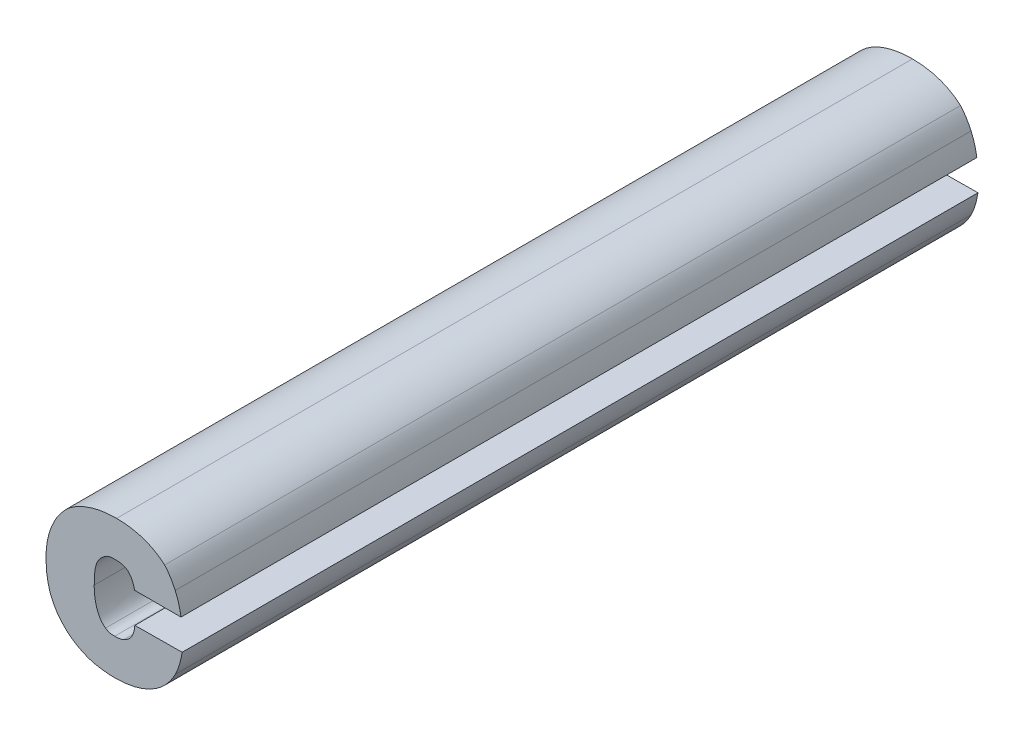
ISO-10303-21;
HEADER;
FILE_DESCRIPTION(('STEP AP214'),'2;1');
FILE_NAME('part.step','',(''),(''),'','','');
FILE_SCHEMA(('AUTOMOTIVE_DESIGN { 1 0 10303 214 1 1 1 1 }'));
ENDSEC;
DATA;
#1=APPLICATION_CONTEXT('core data for automotive mechanical design processes');
#2=APPLICATION_PROTOCOL_DEFINITION('international standard','automotive_design',2000,#1);
#3=PRODUCT_CONTEXT('',#1,'mechanical');
#4=PRODUCT('Part','Part','',(#3));
#5=PRODUCT_RELATED_PRODUCT_CATEGORY('part','',(#4));
#6=PRODUCT_DEFINITION_FORMATION('','',#4);
#7=PRODUCT_DEFINITION_CONTEXT('part definition',#1,'design');
#8=PRODUCT_DEFINITION('design','',#6,#7);
#9=PRODUCT_DEFINITION_SHAPE('','',#8);
#10=(LENGTH_UNIT() NAMED_UNIT(*) SI_UNIT(.MILLI.,.METRE.));
#11=(NAMED_UNIT(*) PLANE_ANGLE_UNIT() SI_UNIT($,.RADIAN.));
#12=(NAMED_UNIT(*) SI_UNIT($,.STERADIAN.) SOLID_ANGLE_UNIT());
#13=UNCERTAINTY_MEASURE_WITH_UNIT(LENGTH_MEASURE(1.E-05),#10,'distance_accuracy_value','');
#14=(GEOMETRIC_REPRESENTATION_CONTEXT(3) GLOBAL_UNCERTAINTY_ASSIGNED_CONTEXT((#13)) GLOBAL_UNIT_ASSIGNED_CONTEXT((#10,
#11,#12)) REPRESENTATION_CONTEXT('',''));
#15=CARTESIAN_POINT('',(0.,0.,0.));
#16=DIRECTION('',(0.,0.,1.));
#17=DIRECTION('',(1.,0.,0.));
#18=AXIS2_PLACEMENT_3D('',#15,#16,#17);
#19=CARTESIAN_POINT('',(1.4394014958136,0.0293407791099617,0.));
#20=CARTESIAN_POINT('',(1.4394014958136,0.0293407791099617,0.1));
#21=CARTESIAN_POINT('',(1.4396914459576,0.0295930409879627,0.));
#22=CARTESIAN_POINT('',(1.4396914459576,0.0295930409879627,0.1));
#23=CARTESIAN_POINT('',(1.4399814040603,0.0298974898329773,0.));
#24=CARTESIAN_POINT('',(1.4399814040603,0.0298974898329773,0.1));
#25=CARTESIAN_POINT('',(1.4408802638323,0.0298974898329742,0.));
#26=CARTESIAN_POINT('',(1.4408802638323,0.0298974898329742,0.1));
#27=B_SPLINE_SURFACE_WITH_KNOTS('',3,1,((#19,#20),(#21,#22),(#23,#24),(#25,#26)),.UNSPECIFIED.,
.F.,.F.,.F.,(4,4),(2,2),(-1.,0.),(0.,0.01),.UNSPECIFIED.);
#28=CARTESIAN_POINT('',(1.4408802638323,0.0298974898329742,0.));
#29=CARTESIAN_POINT('',(1.4399814040603,0.0298974898329773,0.));
#30=CARTESIAN_POINT('',(1.4396914459576,0.0295930409879627,0.));
#31=CARTESIAN_POINT('',(1.4394014958136,0.0293407791099617,0.));
#32=B_SPLINE_CURVE_WITH_KNOTS('',3,(#28,#29,#30,#31),.UNSPECIFIED.,.F.,.F.,(4,4),(0.,1.),.UNSPECIFIED.);
#33=CARTESIAN_POINT('',(1.4408802638323,0.0298974898329742,0.));
#34=VERTEX_POINT('',#33);
#35=CARTESIAN_POINT('',(1.4394014958136,0.0293407791099617,0.));
#36=VERTEX_POINT('',#35);
#37=EDGE_CURVE('E11',#34,#36,#32,.T.);
#38=DIRECTION('',(0.,0.,1.));
#39=VECTOR('',#38,1.);
#40=CARTESIAN_POINT('',(1.4408802638323,0.0298974898329742,0.));
#41=LINE('',#40,#39);
#42=CARTESIAN_POINT('',(1.4408802638323,0.0298974898329742,0.1));
#43=VERTEX_POINT('',#42);
#44=EDGE_CURVE('E28',#34,#43,#41,.T.);
#45=CARTESIAN_POINT('',(1.4394014958136,0.0293407791099617,0.1));
#46=CARTESIAN_POINT('',(1.4396914459576,0.0295930409879627,0.1));
#47=CARTESIAN_POINT('',(1.4399814040603,0.0298974898329773,0.1));
#48=CARTESIAN_POINT('',(1.4408802638323,0.0298974898329742,0.1));
#49=B_SPLINE_CURVE_WITH_KNOTS('',3,(#45,#46,#47,#48),.UNSPECIFIED.,.F.,.F.,(4,4),(-1.,0.),.UNSPECIFIED.);
#50=CARTESIAN_POINT('',(1.4394014958136,0.0293407791099617,0.1));
#51=VERTEX_POINT('',#50);
#52=EDGE_CURVE('E176',#51,#43,#49,.T.);
#53=DIRECTION('',(0.,0.,1.));
#54=VECTOR('',#53,1.);
#55=CARTESIAN_POINT('',(1.4394014958136,0.0293407791099617,0.));
#56=LINE('',#55,#54);
#57=EDGE_CURVE('E480',#36,#51,#56,.T.);
#58=ORIENTED_EDGE('',*,*,#37,.F.);
#59=ORIENTED_EDGE('',*,*,#44,.T.);
#60=ORIENTED_EDGE('',*,*,#52,.F.);
#61=ORIENTED_EDGE('',*,*,#57,.F.);
#62=EDGE_LOOP('',(#58,#59,#60,#61));
#63=FACE_BOUND('',#62,.T.);
#64=ADVANCED_FACE('F17',(#63),#27,.T.);
#65=CARTESIAN_POINT('',(1.4383576530109,0.0257859292219617,0.));
#66=CARTESIAN_POINT('',(1.4383576530109,0.0257859292219617,0.1));
#67=CARTESIAN_POINT('',(1.4383576530332,0.0278475083954069,0.));
#68=CARTESIAN_POINT('',(1.4383576530332,0.0278475083954069,0.1));
#69=CARTESIAN_POINT('',(1.4386186117318,0.0286738806352979,0.));
#70=CARTESIAN_POINT('',(1.4386186117318,0.0286738806352979,0.1));
#71=CARTESIAN_POINT('',(1.4394014958136,0.0293407791099617,0.));
#72=CARTESIAN_POINT('',(1.4394014958136,0.0293407791099617,0.1));
#73=B_SPLINE_SURFACE_WITH_KNOTS('',3,1,((#65,#66),(#67,#68),(#69,#70),(#71,#72)),.UNSPECIFIED.,
.F.,.F.,.F.,(4,4),(2,2),(-1.,0.),(0.,0.01),.UNSPECIFIED.);
#74=CARTESIAN_POINT('',(1.4394014958136,0.0293407791099617,0.));
#75=CARTESIAN_POINT('',(1.4386186117318,0.0286738806352979,0.));
#76=CARTESIAN_POINT('',(1.4383576530332,0.0278475083954069,0.));
#77=CARTESIAN_POINT('',(1.4383576530109,0.0257859292219617,0.));
#78=B_SPLINE_CURVE_WITH_KNOTS('',3,(#74,#75,#76,#77),.UNSPECIFIED.,.F.,.F.,(4,4),(0.,1.),.UNSPECIFIED.);
#79=CARTESIAN_POINT('',(1.4383576530109,0.0257859292219617,0.));
#80=VERTEX_POINT('',#79);
#81=EDGE_CURVE('E473',#36,#80,#78,.T.);
#82=CARTESIAN_POINT('',(1.4383576530109,0.0257859292219617,0.1));
#83=CARTESIAN_POINT('',(1.4383576530332,0.0278475083954069,0.1));
#84=CARTESIAN_POINT('',(1.4386186117318,0.0286738806352979,0.1));
#85=CARTESIAN_POINT('',(1.4394014958136,0.0293407791099617,0.1));
#86=B_SPLINE_CURVE_WITH_KNOTS('',3,(#82,#83,#84,#85),.UNSPECIFIED.,.F.,.F.,(4,4),(-1.,0.),.UNSPECIFIED.);
#87=CARTESIAN_POINT('',(1.4383576530109,0.0257859292219617,0.1));
#88=VERTEX_POINT('',#87);
#89=EDGE_CURVE('E469',#88,#51,#86,.T.);
#90=DIRECTION('',(0.,0.,1.));
#91=VECTOR('',#90,1.);
#92=CARTESIAN_POINT('',(1.4383576530109,0.0257859292219617,0.));
#93=LINE('',#92,#91);
#94=EDGE_CURVE('E463',#80,#88,#93,.T.);
#95=ORIENTED_EDGE('',*,*,#81,.F.);
#96=ORIENTED_EDGE('',*,*,#57,.T.);
#97=ORIENTED_EDGE('',*,*,#89,.F.);
#98=ORIENTED_EDGE('',*,*,#94,.F.);
#99=EDGE_LOOP('',(#95,#96,#97,#98));
#100=FACE_BOUND('',#99,.T.);
#101=ADVANCED_FACE('F558',(#100),#73,.T.);
#102=CARTESIAN_POINT('',(1.4397784341843,0.0218280444952952,0.));
#103=CARTESIAN_POINT('',(1.4397784341843,0.0218280444952952,0.1));
#104=CARTESIAN_POINT('',(1.4382706667306,0.0228747782849252,0.));
#105=CARTESIAN_POINT('',(1.4382706667306,0.0228747782849252,0.1));
#106=CARTESIAN_POINT('',(1.4383576530086,0.0256293484242973,0.));
#107=CARTESIAN_POINT('',(1.4383576530086,0.0256293484242973,0.1));
#108=CARTESIAN_POINT('',(1.4383576530109,0.0257859292219617,0.));
#109=CARTESIAN_POINT('',(1.4383576530109,0.0257859292219617,0.1));
#110=B_SPLINE_SURFACE_WITH_KNOTS('',3,1,((#102,#103),(#104,#105),(#106,#107),(#108,#109)),
.UNSPECIFIED.,.F.,.F.,.F.,(4,4),(2,2),(-1.,0.),(0.,0.01),.UNSPECIFIED.);
#111=CARTESIAN_POINT('',(1.4383576530109,0.0257859292219617,0.));
#112=CARTESIAN_POINT('',(1.4383576530086,0.0256293484242973,0.));
#113=CARTESIAN_POINT('',(1.4382706667306,0.0228747782849252,0.));
#114=CARTESIAN_POINT('',(1.4397784341843,0.0218280444952952,0.));
#115=B_SPLINE_CURVE_WITH_KNOTS('',3,(#111,#112,#113,#114),.UNSPECIFIED.,.F.,.F.,(4,4),(0.,1.),.UNSPECIFIED.);
#116=CARTESIAN_POINT('',(1.4397784341843,0.0218280444952952,0.));
#117=VERTEX_POINT('',#116);
#118=EDGE_CURVE('E456',#80,#117,#115,.T.);
#119=CARTESIAN_POINT('',(1.4397784341843,0.0218280444952952,0.1));
#120=CARTESIAN_POINT('',(1.4382706667306,0.0228747782849252,0.1));
#121=CARTESIAN_POINT('',(1.4383576530086,0.0256293484242973,0.1));
#122=CARTESIAN_POINT('',(1.4383576530109,0.0257859292219617,0.1));
#123=B_SPLINE_CURVE_WITH_KNOTS('',3,(#119,#120,#121,#122),.UNSPECIFIED.,.F.,.F.,(4,4),(-1.,0.),.UNSPECIFIED.);
#124=CARTESIAN_POINT('',(1.4397784341843,0.0218280444952952,0.1));
#125=VERTEX_POINT('',#124);
#126=EDGE_CURVE('E451',#125,#88,#123,.T.);
#127=DIRECTION('',(0.,0.,1.));
#128=VECTOR('',#127,1.);
#129=CARTESIAN_POINT('',(1.4397784341843,0.0218280444952952,0.));
#130=LINE('',#129,#128);
#131=EDGE_CURVE('E445',#117,#125,#130,.T.);
#132=ORIENTED_EDGE('',*,*,#118,.F.);
#133=ORIENTED_EDGE('',*,*,#94,.T.);
#134=ORIENTED_EDGE('',*,*,#126,.F.);
#135=ORIENTED_EDGE('',*,*,#131,.F.);
#136=EDGE_LOOP('',(#132,#133,#134,#135));
#137=FACE_BOUND('',#136,.T.);
#138=ADVANCED_FACE('F554',(#137),#110,.T.);
#139=CARTESIAN_POINT('',(1.4409382546569,0.0215235896812952,0.));
#140=CARTESIAN_POINT('',(1.4409382546569,0.0215235896812952,0.1));
#141=CARTESIAN_POINT('',(1.4404163352498,0.0215235896908047,0.));
#142=CARTESIAN_POINT('',(1.4404163352498,0.0215235896908047,0.1));
#143=CARTESIAN_POINT('',(1.4402133653736,0.0215409833537755,0.));
#144=CARTESIAN_POINT('',(1.4402133653736,0.0215409833537755,0.1));
#145=CARTESIAN_POINT('',(1.4397784341843,0.0218280444952952,0.));
#146=CARTESIAN_POINT('',(1.4397784341843,0.0218280444952952,0.1));
#147=B_SPLINE_SURFACE_WITH_KNOTS('',3,1,((#139,#140),(#141,#142),(#143,#144),(#145,#146)),
.UNSPECIFIED.,.F.,.F.,.F.,(4,4),(2,2),(-1.,0.),(0.,0.01),.UNSPECIFIED.);
#148=CARTESIAN_POINT('',(1.4397784341843,0.0218280444952952,0.));
#149=CARTESIAN_POINT('',(1.4402133653736,0.0215409833537755,0.));
#150=CARTESIAN_POINT('',(1.4404163352498,0.0215235896908047,0.));
#151=CARTESIAN_POINT('',(1.4409382546569,0.0215235896812952,0.));
#152=B_SPLINE_CURVE_WITH_KNOTS('',3,(#148,#149,#150,#151),.UNSPECIFIED.,.F.,.F.,(4,4),(0.,1.),.UNSPECIFIED.);
#153=CARTESIAN_POINT('',(1.4409382546569,0.0215235896812952,0.));
#154=VERTEX_POINT('',#153);
#155=EDGE_CURVE('E438',#117,#154,#152,.T.);
#156=CARTESIAN_POINT('',(1.4409382546569,0.0215235896812952,0.1));
#157=CARTESIAN_POINT('',(1.4404163352498,0.0215235896908047,0.1));
#158=CARTESIAN_POINT('',(1.4402133653736,0.0215409833537755,0.1));
#159=CARTESIAN_POINT('',(1.4397784341843,0.0218280444952952,0.1));
#160=B_SPLINE_CURVE_WITH_KNOTS('',3,(#156,#157,#158,#159),.UNSPECIFIED.,.F.,.F.,(4,4),(-1.,0.),.UNSPECIFIED.);
#161=CARTESIAN_POINT('',(1.4409382546569,0.0215235896812952,0.1));
#162=VERTEX_POINT('',#161);
#163=EDGE_CURVE('E433',#162,#125,#160,.T.);
#164=DIRECTION('',(0.,0.,1.));
#165=VECTOR('',#164,1.);
#166=CARTESIAN_POINT('',(1.4409382546569,0.0215235896812952,0.));
#167=LINE('',#166,#165);
#168=EDGE_CURVE('E427',#154,#162,#167,.T.);
#169=ORIENTED_EDGE('',*,*,#155,.F.);
#170=ORIENTED_EDGE('',*,*,#131,.T.);
#171=ORIENTED_EDGE('',*,*,#163,.F.);
#172=ORIENTED_EDGE('',*,*,#168,.F.);
#173=EDGE_LOOP('',(#169,#170,#171,#172));
#174=FACE_BOUND('',#173,.T.);
#175=ADVANCED_FACE('F550',(#174),#147,.T.);
#176=CARTESIAN_POINT('',(1.4420980751296,0.0217265615469617,0.));
#177=CARTESIAN_POINT('',(1.4420980751296,0.0217265615469617,0.1));
#178=CARTESIAN_POINT('',(1.4416341445529,0.0215061900462939,0.));
#179=CARTESIAN_POINT('',(1.4416341445529,0.0215061900462939,0.1));
#180=CARTESIAN_POINT('',(1.4411122271309,0.0215235896812992,0.));
#181=CARTESIAN_POINT('',(1.4411122271309,0.0215235896812992,0.1));
#182=CARTESIAN_POINT('',(1.4409382546569,0.0215235896812952,0.));
#183=CARTESIAN_POINT('',(1.4409382546569,0.0215235896812952,0.1));
#184=B_SPLINE_SURFACE_WITH_KNOTS('',3,1,((#176,#177),(#178,#179),(#180,#181),(#182,#183)),
.UNSPECIFIED.,.F.,.F.,.F.,(4,4),(2,2),(-1.,0.),(0.,0.01),.UNSPECIFIED.);
#185=CARTESIAN_POINT('',(1.4409382546569,0.0215235896812952,0.));
#186=CARTESIAN_POINT('',(1.4411122271309,0.0215235896812992,0.));
#187=CARTESIAN_POINT('',(1.4416341445529,0.0215061900462939,0.));
#188=CARTESIAN_POINT('',(1.4420980751296,0.0217265615469617,0.));
#189=B_SPLINE_CURVE_WITH_KNOTS('',3,(#185,#186,#187,#188),.UNSPECIFIED.,.F.,.F.,(4,4),(0.,1.),.UNSPECIFIED.);
#190=CARTESIAN_POINT('',(1.4420980751296,0.0217265615469617,0.));
#191=VERTEX_POINT('',#190);
#192=EDGE_CURVE('E420',#154,#191,#189,.T.);
#193=CARTESIAN_POINT('',(1.4420980751296,0.0217265615469617,0.1));
#194=CARTESIAN_POINT('',(1.4416341445529,0.0215061900462939,0.1));
#195=CARTESIAN_POINT('',(1.4411122271309,0.0215235896812992,0.1));
#196=CARTESIAN_POINT('',(1.4409382546569,0.0215235896812952,0.1));
#197=B_SPLINE_CURVE_WITH_KNOTS('',3,(#193,#194,#195,#196),.UNSPECIFIED.,.F.,.F.,(4,4),(-1.,0.),.UNSPECIFIED.);
#198=CARTESIAN_POINT('',(1.4420980751296,0.0217265615469617,0.1));
#199=VERTEX_POINT('',#198);
#200=EDGE_CURVE('E415',#199,#162,#197,.T.);
#201=DIRECTION('',(0.,0.,1.));
#202=VECTOR('',#201,1.);
#203=CARTESIAN_POINT('',(1.4420980751296,0.0217265615469617,0.));
#204=LINE('',#203,#202);
#205=EDGE_CURVE('E409',#191,#199,#204,.T.);
#206=ORIENTED_EDGE('',*,*,#192,.F.);
#207=ORIENTED_EDGE('',*,*,#168,.T.);
#208=ORIENTED_EDGE('',*,*,#200,.F.);
#209=ORIENTED_EDGE('',*,*,#205,.F.);
#210=EDGE_LOOP('',(#206,#207,#208,#209));
#211=FACE_BOUND('',#210,.T.);
#212=ADVANCED_FACE('F546',(#211),#184,.T.);
#213=CARTESIAN_POINT('',(1.4434608654783,0.0239621112202952,0.));
#214=CARTESIAN_POINT('',(1.4434608654783,0.0239621112202952,0.1));
#215=CARTESIAN_POINT('',(1.4433448818562,0.0225326331876867,0.));
#216=CARTESIAN_POINT('',(1.4433448818562,0.0225326331876867,0.1));
#217=CARTESIAN_POINT('',(1.4427069787945,0.0220107157791317,0.));
#218=CARTESIAN_POINT('',(1.4427069787945,0.0220107157791317,0.1));
#219=CARTESIAN_POINT('',(1.4420980751296,0.0217265615469617,0.));
#220=CARTESIAN_POINT('',(1.4420980751296,0.0217265615469617,0.1));
#221=B_SPLINE_SURFACE_WITH_KNOTS('',3,1,((#213,#214),(#215,#216),(#217,#218),(#219,#220)),
.UNSPECIFIED.,.F.,.F.,.F.,(4,4),(2,2),(-1.,0.),(0.,0.01),.UNSPECIFIED.);
#222=CARTESIAN_POINT('',(1.4420980751296,0.0217265615469617,0.));
#223=CARTESIAN_POINT('',(1.4427069787945,0.0220107157791317,0.));
#224=CARTESIAN_POINT('',(1.4433448818562,0.0225326331876867,0.));
#225=CARTESIAN_POINT('',(1.4434608654783,0.0239621112202952,0.));
#226=B_SPLINE_CURVE_WITH_KNOTS('',3,(#222,#223,#224,#225),.UNSPECIFIED.,.F.,.F.,(4,4),(0.,1.),.UNSPECIFIED.);
#227=CARTESIAN_POINT('',(1.4434608654783,0.0239621112202952,0.));
#228=VERTEX_POINT('',#227);
#229=EDGE_CURVE('E402',#191,#228,#226,.T.);
#230=CARTESIAN_POINT('',(1.4434608654783,0.0239621112202952,0.1));
#231=CARTESIAN_POINT('',(1.4433448818562,0.0225326331876867,0.1));
#232=CARTESIAN_POINT('',(1.4427069787945,0.0220107157791317,0.1));
#233=CARTESIAN_POINT('',(1.4420980751296,0.0217265615469617,0.1));
#234=B_SPLINE_CURVE_WITH_KNOTS('',3,(#230,#231,#232,#233),.UNSPECIFIED.,.F.,.F.,(4,4),(-1.,0.),.UNSPECIFIED.);
#235=CARTESIAN_POINT('',(1.4434608654783,0.0239621112202952,0.1));
#236=VERTEX_POINT('',#235);
#237=EDGE_CURVE('E397',#236,#199,#234,.T.);
#238=DIRECTION('',(0.,0.,1.));
#239=VECTOR('',#238,1.);
#240=CARTESIAN_POINT('',(1.4434608654783,0.0239621112202952,0.));
#241=LINE('',#240,#239);
#242=EDGE_CURVE('E394',#228,#236,#241,.T.);
#243=ORIENTED_EDGE('',*,*,#229,.F.);
#244=ORIENTED_EDGE('',*,*,#205,.T.);
#245=ORIENTED_EDGE('',*,*,#237,.F.);
#246=ORIENTED_EDGE('',*,*,#242,.F.);
#247=EDGE_LOOP('',(#243,#244,#245,#246));
#248=FACE_BOUND('',#247,.T.);
#249=ADVANCED_FACE('F542',(#248),#221,.T.);
#250=CARTESIAN_POINT('',(1.4494049429136,0.0240113992429617,0.));
#251=DIRECTION('',(-0.0082916699611543,0.999965623513756,0.));
#252=DIRECTION('',(-0.999965623513756,-0.0082916699611543,0.));
#253=AXIS2_PLACEMENT_3D('',#250,#251,#252);
#254=PLANE('',#253);
#255=DIRECTION('',(0.999965623513756,0.0082916699611543,0.));
#256=VECTOR('',#255,1.);
#257=CARTESIAN_POINT('',(1.4434608654783,0.0239621112202952,0.));
#258=LINE('',#257,#256);
#259=CARTESIAN_POINT('',(1.4494049429136,0.0240113992429617,0.));
#260=VERTEX_POINT('',#259);
#261=EDGE_CURVE('E392',#228,#260,#258,.T.);
#262=ORIENTED_EDGE('',*,*,#261,.F.);
#263=ORIENTED_EDGE('',*,*,#242,.T.);
#264=DIRECTION('',(-0.999965623513756,-0.0082916699611543,0.));
#265=VECTOR('',#264,1.);
#266=CARTESIAN_POINT('',(1.4434608654783,0.0239621112202952,0.1));
#267=LINE('',#266,#265);
#268=CARTESIAN_POINT('',(1.4494049429136,0.0240113992429617,0.1));
#269=VERTEX_POINT('',#268);
#270=EDGE_CURVE('E389',#269,#236,#267,.T.);
#271=ORIENTED_EDGE('',*,*,#270,.F.);
#272=DIRECTION('',(0.,0.,1.));
#273=VECTOR('',#272,1.);
#274=CARTESIAN_POINT('',(1.4494049429136,0.0240113992429617,0.));
#275=LINE('',#274,#273);
#276=EDGE_CURVE('E383',#260,#269,#275,.T.);
#277=ORIENTED_EDGE('',*,*,#276,.F.);
#278=EDGE_LOOP('',(#262,#263,#271,#277));
#279=FACE_BOUND('',#278,.T.);
#280=ADVANCED_FACE('F538',(#279),#254,.T.);
#281=CARTESIAN_POINT('',(1.4485350805436,0.0211698408756287,0.));
#282=CARTESIAN_POINT('',(1.4485350805436,0.0211698408756287,0.1));
#283=CARTESIAN_POINT('',(1.4491149868007,0.0222803713359596,0.));
#284=CARTESIAN_POINT('',(1.4491149868007,0.0222803713359596,0.1));
#285=CARTESIAN_POINT('',(1.4493469540785,0.0236286649732964,0.));
#286=CARTESIAN_POINT('',(1.4493469540785,0.0236286649732964,0.1));
#287=CARTESIAN_POINT('',(1.4494049429136,0.0240113992429617,0.));
#288=CARTESIAN_POINT('',(1.4494049429136,0.0240113992429617,0.1));
#289=B_SPLINE_SURFACE_WITH_KNOTS('',3,1,((#281,#282),(#283,#284),(#285,#286),(#287,#288)),
.UNSPECIFIED.,.F.,.F.,.F.,(4,4),(2,2),(-1.,0.),(0.,0.01),.UNSPECIFIED.);
#290=CARTESIAN_POINT('',(1.4494049429136,0.0240113992429617,0.));
#291=CARTESIAN_POINT('',(1.4493469540785,0.0236286649732964,0.));
#292=CARTESIAN_POINT('',(1.4491149868007,0.0222803713359596,0.));
#293=CARTESIAN_POINT('',(1.4485350805436,0.0211698408756287,0.));
#294=B_SPLINE_CURVE_WITH_KNOTS('',3,(#290,#291,#292,#293),.UNSPECIFIED.,.F.,.F.,(4,4),(0.,1.),.UNSPECIFIED.);
#295=CARTESIAN_POINT('',(1.4485350805436,0.0211698408756287,0.));
#296=VERTEX_POINT('',#295);
#297=EDGE_CURVE('E376',#260,#296,#294,.T.);
#298=CARTESIAN_POINT('',(1.4485350805436,0.0211698408756287,0.1));
#299=CARTESIAN_POINT('',(1.4491149868007,0.0222803713359596,0.1));
#300=CARTESIAN_POINT('',(1.4493469540785,0.0236286649732964,0.1));
#301=CARTESIAN_POINT('',(1.4494049429136,0.0240113992429617,0.1));
#302=B_SPLINE_CURVE_WITH_KNOTS('',3,(#298,#299,#300,#301),.UNSPECIFIED.,.F.,.F.,(4,4),(-1.,0.),.UNSPECIFIED.);
#303=CARTESIAN_POINT('',(1.4485350805436,0.0211698408756287,0.1));
#304=VERTEX_POINT('',#303);
#305=EDGE_CURVE('E371',#304,#269,#302,.T.);
#306=DIRECTION('',(0.,0.,1.));
#307=VECTOR('',#306,1.);
#308=CARTESIAN_POINT('',(1.4485350805436,0.0211698408756287,0.));
#309=LINE('',#308,#307);
#310=EDGE_CURVE('E365',#296,#304,#309,.T.);
#311=ORIENTED_EDGE('',*,*,#297,.F.);
#312=ORIENTED_EDGE('',*,*,#276,.T.);
#313=ORIENTED_EDGE('',*,*,#305,.F.);
#314=ORIENTED_EDGE('',*,*,#310,.F.);
#315=EDGE_LOOP('',(#311,#312,#313,#314));
#316=FACE_BOUND('',#315,.T.);
#317=ADVANCED_FACE('F534',(#316),#289,.T.);
#318=CARTESIAN_POINT('',(1.4409962494609,0.0169915926069742,0.));
#319=CARTESIAN_POINT('',(1.4409962494609,0.0169915926069742,0.1));
#320=CARTESIAN_POINT('',(1.4440407717353,0.0169915926069784,0.));
#321=CARTESIAN_POINT('',(1.4440407717353,0.0169915926069784,0.1));
#322=CARTESIAN_POINT('',(1.4470563105352,0.0182209996816288,0.));
#323=CARTESIAN_POINT('',(1.4470563105352,0.0182209996816288,0.1));
#324=CARTESIAN_POINT('',(1.4485350805436,0.0211698408756287,0.));
#325=CARTESIAN_POINT('',(1.4485350805436,0.0211698408756287,0.1));
#326=B_SPLINE_SURFACE_WITH_KNOTS('',3,1,((#318,#319),(#320,#321),(#322,#323),(#324,#325)),
.UNSPECIFIED.,.F.,.F.,.F.,(4,4),(2,2),(-1.,0.),(0.,0.01),.UNSPECIFIED.);
#327=CARTESIAN_POINT('',(1.4485350805436,0.0211698408756287,0.));
#328=CARTESIAN_POINT('',(1.4470563105352,0.0182209996816288,0.));
#329=CARTESIAN_POINT('',(1.4440407717353,0.0169915926069784,0.));
#330=CARTESIAN_POINT('',(1.4409962494609,0.0169915926069742,0.));
#331=B_SPLINE_CURVE_WITH_KNOTS('',3,(#327,#328,#329,#330),.UNSPECIFIED.,.F.,.F.,(4,4),(0.,1.),.UNSPECIFIED.);
#332=CARTESIAN_POINT('',(1.4409962494609,0.0169915926069742,0.));
#333=VERTEX_POINT('',#332);
#334=EDGE_CURVE('E358',#296,#333,#331,.T.);
#335=CARTESIAN_POINT('',(1.4409962494609,0.0169915926069742,0.1));
#336=CARTESIAN_POINT('',(1.4440407717353,0.0169915926069784,0.1));
#337=CARTESIAN_POINT('',(1.4470563105352,0.0182209996816288,0.1));
#338=CARTESIAN_POINT('',(1.4485350805436,0.0211698408756287,0.1));
#339=B_SPLINE_CURVE_WITH_KNOTS('',3,(#335,#336,#337,#338),.UNSPECIFIED.,.F.,.F.,(4,4),(-1.,0.),.UNSPECIFIED.);
#340=CARTESIAN_POINT('',(1.4409962494609,0.0169915926069742,0.1));
#341=VERTEX_POINT('',#340);
#342=EDGE_CURVE('E353',#341,#304,#339,.T.);
#343=DIRECTION('',(0.,0.,1.));
#344=VECTOR('',#343,1.);
#345=CARTESIAN_POINT('',(1.4409962494609,0.0169915926069742,0.));
#346=LINE('',#345,#344);
#347=EDGE_CURVE('E347',#333,#341,#346,.T.);
#348=ORIENTED_EDGE('',*,*,#334,.F.);
#349=ORIENTED_EDGE('',*,*,#310,.T.);
#350=ORIENTED_EDGE('',*,*,#342,.F.);
#351=ORIENTED_EDGE('',*,*,#347,.F.);
#352=EDGE_LOOP('',(#348,#349,#350,#351));
#353=FACE_BOUND('',#352,.T.);
#354=ADVANCED_FACE('F530',(#353),#326,.T.);
#355=CARTESIAN_POINT('',(1.4383576530109,0.0172757468519742,0.));
#356=CARTESIAN_POINT('',(1.4383576530109,0.0172757468519742,0.1));
#357=CARTESIAN_POINT('',(1.4388795724237,0.0171800578260401,0.));
#358=CARTESIAN_POINT('',(1.4388795724237,0.0171800578260401,0.1));
#359=CARTESIAN_POINT('',(1.4397494427512,0.016991592614674,0.));
#360=CARTESIAN_POINT('',(1.4397494427512,0.016991592614674,0.1));
#361=CARTESIAN_POINT('',(1.4409962494609,0.0169915926069742,0.));
#362=CARTESIAN_POINT('',(1.4409962494609,0.0169915926069742,0.1));
#363=B_SPLINE_SURFACE_WITH_KNOTS('',3,1,((#355,#356),(#357,#358),(#359,#360),(#361,#362)),
.UNSPECIFIED.,.F.,.F.,.F.,(4,4),(2,2),(-1.,0.),(0.,0.01),.UNSPECIFIED.);
#364=CARTESIAN_POINT('',(1.4409962494609,0.0169915926069742,0.));
#365=CARTESIAN_POINT('',(1.4397494427512,0.016991592614674,0.));
#366=CARTESIAN_POINT('',(1.4388795724237,0.0171800578260401,0.));
#367=CARTESIAN_POINT('',(1.4383576530109,0.0172757468519742,0.));
#368=B_SPLINE_CURVE_WITH_KNOTS('',3,(#364,#365,#366,#367),.UNSPECIFIED.,.F.,.F.,(4,4),(0.,1.),.UNSPECIFIED.);
#369=CARTESIAN_POINT('',(1.4383576530109,0.0172757468519742,0.));
#370=VERTEX_POINT('',#369);
#371=EDGE_CURVE('E340',#333,#370,#368,.T.);
#372=CARTESIAN_POINT('',(1.4383576530109,0.0172757468519742,0.1));
#373=CARTESIAN_POINT('',(1.4388795724237,0.0171800578260401,0.1));
#374=CARTESIAN_POINT('',(1.4397494427512,0.016991592614674,0.1));
#375=CARTESIAN_POINT('',(1.4409962494609,0.0169915926069742,0.1));
#376=B_SPLINE_CURVE_WITH_KNOTS('',3,(#372,#373,#374,#375),.UNSPECIFIED.,.F.,.F.,(4,4),(-1.,0.),.UNSPECIFIED.);
#377=CARTESIAN_POINT('',(1.4383576530109,0.0172757468519742,0.1));
#378=VERTEX_POINT('',#377);
#379=EDGE_CURVE('E335',#378,#341,#376,.T.);
#380=DIRECTION('',(0.,0.,1.));
#381=VECTOR('',#380,1.);
#382=CARTESIAN_POINT('',(1.4383576530109,0.0172757468519742,0.));
#383=LINE('',#382,#381);
#384=EDGE_CURVE('E329',#370,#378,#383,.T.);
#385=ORIENTED_EDGE('',*,*,#371,.F.);
#386=ORIENTED_EDGE('',*,*,#347,.T.);
#387=ORIENTED_EDGE('',*,*,#379,.F.);
#388=ORIENTED_EDGE('',*,*,#384,.F.);
#389=EDGE_LOOP('',(#385,#386,#387,#388));
#390=FACE_BOUND('',#389,.T.);
#391=ADVANCED_FACE('F526',(#390),#363,.T.);
#392=CARTESIAN_POINT('',(1.4329065015646,0.0219701206229617,0.));
#393=CARTESIAN_POINT('',(1.4329065015646,0.0219701206229617,0.1));
#394=CARTESIAN_POINT('',(1.4338343547593,0.0195605964859727,0.));
#395=CARTESIAN_POINT('',(1.4338343547593,0.0195605964859727,0.1));
#396=CARTESIAN_POINT('',(1.4359510238389,0.0178788546119746,0.));
#397=CARTESIAN_POINT('',(1.4359510238389,0.0178788546119746,0.1));
#398=CARTESIAN_POINT('',(1.4383576530109,0.0172757468519742,0.));
#399=CARTESIAN_POINT('',(1.4383576530109,0.0172757468519742,0.1));
#400=B_SPLINE_SURFACE_WITH_KNOTS('',3,1,((#392,#393),(#394,#395),(#396,#397),(#398,#399)),
.UNSPECIFIED.,.F.,.F.,.F.,(4,4),(2,2),(-1.,0.),(0.,0.01),.UNSPECIFIED.);
#401=CARTESIAN_POINT('',(1.4383576530109,0.0172757468519742,0.));
#402=CARTESIAN_POINT('',(1.4359510238389,0.0178788546119746,0.));
#403=CARTESIAN_POINT('',(1.4338343547593,0.0195605964859727,0.));
#404=CARTESIAN_POINT('',(1.4329065015646,0.0219701206229617,0.));
#405=B_SPLINE_CURVE_WITH_KNOTS('',3,(#401,#402,#403,#404),.UNSPECIFIED.,.F.,.F.,(4,4),(0.,1.),.UNSPECIFIED.);
#406=CARTESIAN_POINT('',(1.4329065015646,0.0219701206229617,0.));
#407=VERTEX_POINT('',#406);
#408=EDGE_CURVE('E322',#370,#407,#405,.T.);
#409=CARTESIAN_POINT('',(1.4329065015646,0.0219701206229617,0.1));
#410=CARTESIAN_POINT('',(1.4338343547593,0.0195605964859727,0.1));
#411=CARTESIAN_POINT('',(1.4359510238389,0.0178788546119746,0.1));
#412=CARTESIAN_POINT('',(1.4383576530109,0.0172757468519742,0.1));
#413=B_SPLINE_CURVE_WITH_KNOTS('',3,(#409,#410,#411,#412),.UNSPECIFIED.,.F.,.F.,(4,4),(-1.,0.),.UNSPECIFIED.);
#414=CARTESIAN_POINT('',(1.4329065015646,0.0219701206229617,0.1));
#415=VERTEX_POINT('',#414);
#416=EDGE_CURVE('E317',#415,#378,#413,.T.);
#417=DIRECTION('',(0.,0.,1.));
#418=VECTOR('',#417,1.);
#419=CARTESIAN_POINT('',(1.4329065015646,0.0219701206229617,0.));
#420=LINE('',#419,#418);
#421=EDGE_CURVE('E311',#407,#415,#420,.T.);
#422=ORIENTED_EDGE('',*,*,#408,.F.);
#423=ORIENTED_EDGE('',*,*,#384,.T.);
#424=ORIENTED_EDGE('',*,*,#416,.F.);
#425=ORIENTED_EDGE('',*,*,#421,.F.);
#426=EDGE_LOOP('',(#422,#423,#424,#425));
#427=FACE_BOUND('',#426,.T.);
#428=ADVANCED_FACE('F522',(#427),#400,.T.);
#429=CARTESIAN_POINT('',(1.4322975919366,0.0256496489932952,0.));
#430=CARTESIAN_POINT('',(1.4322975919366,0.0256496489932952,0.1));
#431=CARTESIAN_POINT('',(1.4322975919366,0.0238084373256306,0.));
#432=CARTESIAN_POINT('',(1.4322975919366,0.0238084373256306,0.1));
#433=CARTESIAN_POINT('',(1.4326455428536,0.0226979068652966,0.));
#434=CARTESIAN_POINT('',(1.4326455428536,0.0226979068652966,0.1));
#435=CARTESIAN_POINT('',(1.4329065015646,0.0219701206229617,0.));
#436=CARTESIAN_POINT('',(1.4329065015646,0.0219701206229617,0.1));
#437=B_SPLINE_SURFACE_WITH_KNOTS('',3,1,((#429,#430),(#431,#432),(#433,#434),(#435,#436)),
.UNSPECIFIED.,.F.,.F.,.F.,(4,4),(2,2),(-1.,0.),(0.,0.01),.UNSPECIFIED.);
#438=CARTESIAN_POINT('',(1.4329065015646,0.0219701206229617,0.));
#439=CARTESIAN_POINT('',(1.4326455428536,0.0226979068652966,0.));
#440=CARTESIAN_POINT('',(1.4322975919366,0.0238084373256306,0.));
#441=CARTESIAN_POINT('',(1.4322975919366,0.0256496489932952,0.));
#442=B_SPLINE_CURVE_WITH_KNOTS('',3,(#438,#439,#440,#441),.UNSPECIFIED.,.F.,.F.,(4,4),(0.,1.),.UNSPECIFIED.);
#443=CARTESIAN_POINT('',(1.4322975919366,0.0256496489932952,0.));
#444=VERTEX_POINT('',#443);
#445=EDGE_CURVE('E304',#407,#444,#442,.T.);
#446=CARTESIAN_POINT('',(1.4322975919366,0.0256496489932952,0.1));
#447=CARTESIAN_POINT('',(1.4322975919366,0.0238084373256306,0.1));
#448=CARTESIAN_POINT('',(1.4326455428536,0.0226979068652966,0.1));
#449=CARTESIAN_POINT('',(1.4329065015646,0.0219701206229617,0.1));
#450=B_SPLINE_CURVE_WITH_KNOTS('',3,(#446,#447,#448,#449),.UNSPECIFIED.,.F.,.F.,(4,4),(-1.,0.),.UNSPECIFIED.);
#451=CARTESIAN_POINT('',(1.4322975919366,0.0256496489932952,0.1));
#452=VERTEX_POINT('',#451);
#453=EDGE_CURVE('E299',#452,#415,#450,.T.);
#454=DIRECTION('',(0.,0.,1.));
#455=VECTOR('',#454,1.);
#456=CARTESIAN_POINT('',(1.4322975919366,0.0256496489932952,0.));
#457=LINE('',#456,#455);
#458=EDGE_CURVE('E293',#444,#452,#457,.T.);
#459=ORIENTED_EDGE('',*,*,#445,.F.);
#460=ORIENTED_EDGE('',*,*,#421,.T.);
#461=ORIENTED_EDGE('',*,*,#453,.F.);
#462=ORIENTED_EDGE('',*,*,#458,.F.);
#463=EDGE_LOOP('',(#459,#460,#461,#462));
#464=FACE_BOUND('',#463,.T.);
#465=ADVANCED_FACE('F518',(#464),#437,.T.);
#466=CARTESIAN_POINT('',(1.4333994215846,0.0303411218302742,0.));
#467=CARTESIAN_POINT('',(1.4333994215846,0.0303411218302742,0.1));
#468=CARTESIAN_POINT('',(1.432326589298,0.0283752316807274,0.));
#469=CARTESIAN_POINT('',(1.432326589298,0.0283752316807274,0.1));
#470=CARTESIAN_POINT('',(1.4322975919253,0.0264093276026256,0.));
#471=CARTESIAN_POINT('',(1.4322975919253,0.0264093276026256,0.1));
#472=CARTESIAN_POINT('',(1.4322975919366,0.0256496489932952,0.));
#473=CARTESIAN_POINT('',(1.4322975919366,0.0256496489932952,0.1));
#474=B_SPLINE_SURFACE_WITH_KNOTS('',3,1,((#466,#467),(#468,#469),(#470,#471),(#472,#473)),
.UNSPECIFIED.,.F.,.F.,.F.,(4,4),(2,2),(-1.,0.),(0.,0.01),.UNSPECIFIED.);
#475=CARTESIAN_POINT('',(1.4322975919366,0.0256496489932952,0.));
#476=CARTESIAN_POINT('',(1.4322975919253,0.0264093276026256,0.));
#477=CARTESIAN_POINT('',(1.432326589298,0.0283752316807274,0.));
#478=CARTESIAN_POINT('',(1.4333994215846,0.0303411218302742,0.));
#479=B_SPLINE_CURVE_WITH_KNOTS('',3,(#475,#476,#477,#478),.UNSPECIFIED.,.F.,.F.,(4,4),(0.,1.),.UNSPECIFIED.);
#480=CARTESIAN_POINT('',(1.4333994215846,0.0303411218302742,0.));
#481=VERTEX_POINT('',#480);
#482=EDGE_CURVE('E286',#444,#481,#479,.T.);
#483=CARTESIAN_POINT('',(1.4333994215846,0.0303411218302742,0.1));
#484=CARTESIAN_POINT('',(1.432326589298,0.0283752316807274,0.1));
#485=CARTESIAN_POINT('',(1.4322975919253,0.0264093276026256,0.1));
#486=CARTESIAN_POINT('',(1.4322975919366,0.0256496489932952,0.1));
#487=B_SPLINE_CURVE_WITH_KNOTS('',3,(#483,#484,#485,#486),.UNSPECIFIED.,.F.,.F.,(4,4),(-1.,0.),.UNSPECIFIED.);
#488=CARTESIAN_POINT('',(1.4333994215846,0.0303411218302742,0.1));
#489=VERTEX_POINT('',#488);
#490=EDGE_CURVE('E281',#489,#452,#487,.T.);
#491=DIRECTION('',(0.,0.,1.));
#492=VECTOR('',#491,1.);
#493=CARTESIAN_POINT('',(1.4333994215846,0.0303411218302742,0.));
#494=LINE('',#493,#492);
#495=EDGE_CURVE('E275',#481,#489,#494,.T.);
#496=ORIENTED_EDGE('',*,*,#482,.F.);
#497=ORIENTED_EDGE('',*,*,#458,.T.);
#498=ORIENTED_EDGE('',*,*,#490,.F.);
#499=ORIENTED_EDGE('',*,*,#495,.F.);
#500=EDGE_LOOP('',(#496,#497,#498,#499));
#501=FACE_BOUND('',#500,.T.);
#502=ADVANCED_FACE('F514',(#501),#474,.T.);
#503=CARTESIAN_POINT('',(1.4347332145313,0.0321794425122742,0.));
#504=CARTESIAN_POINT('',(1.4347332145313,0.0321794425122742,0.1));
#505=CARTESIAN_POINT('',(1.4340373286147,0.0314516463216281,0.));
#506=CARTESIAN_POINT('',(1.4340373286147,0.0314516463216281,0.1));
#507=CARTESIAN_POINT('',(1.4335443986463,0.0306571744112769,0.));
#508=CARTESIAN_POINT('',(1.4335443986463,0.0306571744112769,0.1));
#509=CARTESIAN_POINT('',(1.4333994215846,0.0303411218302742,0.));
#510=CARTESIAN_POINT('',(1.4333994215846,0.0303411218302742,0.1));
#511=B_SPLINE_SURFACE_WITH_KNOTS('',3,1,((#503,#504),(#505,#506),(#507,#508),(#509,#510)),
.UNSPECIFIED.,.F.,.F.,.F.,(4,4),(2,2),(-1.,0.),(0.,0.01),.UNSPECIFIED.);
#512=CARTESIAN_POINT('',(1.4333994215846,0.0303411218302742,0.));
#513=CARTESIAN_POINT('',(1.4335443986463,0.0306571744112769,0.));
#514=CARTESIAN_POINT('',(1.4340373286147,0.0314516463216281,0.));
#515=CARTESIAN_POINT('',(1.4347332145313,0.0321794425122742,0.));
#516=B_SPLINE_CURVE_WITH_KNOTS('',3,(#512,#513,#514,#515),.UNSPECIFIED.,.F.,.F.,(4,4),(0.,1.),.UNSPECIFIED.);
#517=CARTESIAN_POINT('',(1.4347332145313,0.0321794425122742,0.));
#518=VERTEX_POINT('',#517);
#519=EDGE_CURVE('E268',#481,#518,#516,.T.);
#520=CARTESIAN_POINT('',(1.4347332145313,0.0321794425122742,0.1));
#521=CARTESIAN_POINT('',(1.4340373286147,0.0314516463216281,0.1));
#522=CARTESIAN_POINT('',(1.4335443986463,0.0306571744112769,0.1));
#523=CARTESIAN_POINT('',(1.4333994215846,0.0303411218302742,0.1));
#524=B_SPLINE_CURVE_WITH_KNOTS('',3,(#520,#521,#522,#523),.UNSPECIFIED.,.F.,.F.,(4,4),(-1.,0.),.UNSPECIFIED.);
#525=CARTESIAN_POINT('',(1.4347332145313,0.0321794425122742,0.1));
#526=VERTEX_POINT('',#525);
#527=EDGE_CURVE('E263',#526,#489,#524,.T.);
#528=DIRECTION('',(0.,0.,1.));
#529=VECTOR('',#528,1.);
#530=CARTESIAN_POINT('',(1.4347332145313,0.0321794425122742,0.));
#531=LINE('',#530,#529);
#532=EDGE_CURVE('E257',#518,#526,#531,.T.);
#533=ORIENTED_EDGE('',*,*,#519,.F.);
#534=ORIENTED_EDGE('',*,*,#495,.T.);
#535=ORIENTED_EDGE('',*,*,#527,.F.);
#536=ORIENTED_EDGE('',*,*,#532,.F.);
#537=EDGE_LOOP('',(#533,#534,#535,#536));
#538=FACE_BOUND('',#537,.T.);
#539=ADVANCED_FACE('F510',(#538),#511,.T.);
#540=CARTESIAN_POINT('',(1.4411702219349,0.0344642841876242,0.));
#541=CARTESIAN_POINT('',(1.4411702219349,0.0344642841876242,0.1));
#542=CARTESIAN_POINT('',(1.4403583464102,0.0344642841876248,0.));
#543=CARTESIAN_POINT('',(1.4403583464102,0.0344642841876248,0.1));
#544=CARTESIAN_POINT('',(1.4369948666416,0.0344004934846271,0.));
#545=CARTESIAN_POINT('',(1.4369948666416,0.0344004934846271,0.1));
#546=CARTESIAN_POINT('',(1.4347332145313,0.0321794425122742,0.));
#547=CARTESIAN_POINT('',(1.4347332145313,0.0321794425122742,0.1));
#548=B_SPLINE_SURFACE_WITH_KNOTS('',3,1,((#540,#541),(#542,#543),(#544,#545),(#546,#547)),
.UNSPECIFIED.,.F.,.F.,.F.,(4,4),(2,2),(-1.,0.),(0.,0.01),.UNSPECIFIED.);
#549=CARTESIAN_POINT('',(1.4347332145313,0.0321794425122742,0.));
#550=CARTESIAN_POINT('',(1.4369948666416,0.0344004934846271,0.));
#551=CARTESIAN_POINT('',(1.4403583464102,0.0344642841876248,0.));
#552=CARTESIAN_POINT('',(1.4411702219349,0.0344642841876242,0.));
#553=B_SPLINE_CURVE_WITH_KNOTS('',3,(#549,#550,#551,#552),.UNSPECIFIED.,.F.,.F.,(4,4),(0.,1.),.UNSPECIFIED.);
#554=CARTESIAN_POINT('',(1.4411702219349,0.0344642841876242,0.));
#555=VERTEX_POINT('',#554);
#556=EDGE_CURVE('E250',#518,#555,#553,.T.);
#557=CARTESIAN_POINT('',(1.4411702219349,0.0344642841876242,0.1));
#558=CARTESIAN_POINT('',(1.4403583464102,0.0344642841876248,0.1));
#559=CARTESIAN_POINT('',(1.4369948666416,0.0344004934846271,0.1));
#560=CARTESIAN_POINT('',(1.4347332145313,0.0321794425122742,0.1));
#561=B_SPLINE_CURVE_WITH_KNOTS('',3,(#557,#558,#559,#560),.UNSPECIFIED.,.F.,.F.,(4,4),(-1.,0.),.UNSPECIFIED.);
#562=CARTESIAN_POINT('',(1.4411702219349,0.0344642841876242,0.1));
#563=VERTEX_POINT('',#562);
#564=EDGE_CURVE('E245',#563,#526,#561,.T.);
#565=DIRECTION('',(0.,0.,1.));
#566=VECTOR('',#565,1.);
#567=CARTESIAN_POINT('',(1.4411702219349,0.0344642841876242,0.));
#568=LINE('',#567,#566);
#569=EDGE_CURVE('E239',#555,#563,#568,.T.);
#570=ORIENTED_EDGE('',*,*,#556,.F.);
#571=ORIENTED_EDGE('',*,*,#532,.T.);
#572=ORIENTED_EDGE('',*,*,#564,.F.);
#573=ORIENTED_EDGE('',*,*,#569,.F.);
#574=EDGE_LOOP('',(#570,#571,#572,#573));
#575=FACE_BOUND('',#574,.T.);
#576=ADVANCED_FACE('F506',(#575),#548,.T.);
#577=CARTESIAN_POINT('',(1.4472012856073,0.0324027010192742,0.));
#578=CARTESIAN_POINT('',(1.4472012856073,0.0324027010192742,0.1));
#579=CARTESIAN_POINT('',(1.4462444350282,0.0332899670792388,0.));
#580=CARTESIAN_POINT('',(1.4462444350282,0.0332899670792388,0.1));
#581=CARTESIAN_POINT('',(1.4443017324359,0.0344642842342877,0.));
#582=CARTESIAN_POINT('',(1.4443017324359,0.0344642842342877,0.1));
#583=CARTESIAN_POINT('',(1.4411702219349,0.0344642841876242,0.));
#584=CARTESIAN_POINT('',(1.4411702219349,0.0344642841876242,0.1));
#585=B_SPLINE_SURFACE_WITH_KNOTS('',3,1,((#577,#578),(#579,#580),(#581,#582),(#583,#584)),
.UNSPECIFIED.,.F.,.F.,.F.,(4,4),(2,2),(-1.,0.),(0.,0.01),.UNSPECIFIED.);
#586=CARTESIAN_POINT('',(1.4411702219349,0.0344642841876242,0.));
#587=CARTESIAN_POINT('',(1.4443017324359,0.0344642842342877,0.));
#588=CARTESIAN_POINT('',(1.4462444350282,0.0332899670792388,0.));
#589=CARTESIAN_POINT('',(1.4472012856073,0.0324027010192742,0.));
#590=B_SPLINE_CURVE_WITH_KNOTS('',3,(#586,#587,#588,#589),.UNSPECIFIED.,.F.,.F.,(4,4),(0.,1.),.UNSPECIFIED.);
#591=CARTESIAN_POINT('',(1.4472012856073,0.0324027010192742,0.));
#592=VERTEX_POINT('',#591);
#593=EDGE_CURVE('E232',#555,#592,#590,.T.);
#594=CARTESIAN_POINT('',(1.4472012856073,0.0324027010192742,0.1));
#595=CARTESIAN_POINT('',(1.4462444350282,0.0332899670792388,0.1));
#596=CARTESIAN_POINT('',(1.4443017324359,0.0344642842342877,0.1));
#597=CARTESIAN_POINT('',(1.4411702219349,0.0344642841876242,0.1));
#598=B_SPLINE_CURVE_WITH_KNOTS('',3,(#594,#595,#596,#597),.UNSPECIFIED.,.F.,.F.,(4,4),(-1.,0.),.UNSPECIFIED.);
#599=CARTESIAN_POINT('',(1.4472012856073,0.0324027010192742,0.1));
#600=VERTEX_POINT('',#599);
#601=EDGE_CURVE('E227',#600,#563,#598,.T.);
#602=DIRECTION('',(0.,0.,1.));
#603=VECTOR('',#602,1.);
#604=CARTESIAN_POINT('',(1.4472012856073,0.0324027010192742,0.));
#605=LINE('',#604,#603);
#606=EDGE_CURVE('E221',#592,#600,#605,.T.);
#607=ORIENTED_EDGE('',*,*,#593,.F.);
#608=ORIENTED_EDGE('',*,*,#569,.T.);
#609=ORIENTED_EDGE('',*,*,#601,.F.);
#610=ORIENTED_EDGE('',*,*,#606,.F.);
#611=EDGE_LOOP('',(#607,#608,#609,#610));
#612=FACE_BOUND('',#611,.T.);
#613=ADVANCED_FACE('F502',(#612),#585,.T.);
#614=CARTESIAN_POINT('',(1.4485350805436,0.0303034315746242,0.));
#615=CARTESIAN_POINT('',(1.4485350805436,0.0303034315746242,0.1));
#616=CARTESIAN_POINT('',(1.4480711499669,0.0313501653629745,0.));
#617=CARTESIAN_POINT('',(1.4480711499669,0.0313501653629745,0.1));
#618=CARTESIAN_POINT('',(1.4474912437099,0.032115649819621,0.));
#619=CARTESIAN_POINT('',(1.4474912437099,0.032115649819621,0.1));
#620=CARTESIAN_POINT('',(1.4472012856073,0.0324027010192742,0.));
#621=CARTESIAN_POINT('',(1.4472012856073,0.0324027010192742,0.1));
#622=B_SPLINE_SURFACE_WITH_KNOTS('',3,1,((#614,#615),(#616,#617),(#618,#619),(#620,#621)),
.UNSPECIFIED.,.F.,.F.,.F.,(4,4),(2,2),(-1.,0.),(0.,0.01),.UNSPECIFIED.);
#623=CARTESIAN_POINT('',(1.4472012856073,0.0324027010192742,0.));
#624=CARTESIAN_POINT('',(1.4474912437099,0.032115649819621,0.));
#625=CARTESIAN_POINT('',(1.4480711499669,0.0313501653629745,0.));
#626=CARTESIAN_POINT('',(1.4485350805436,0.0303034315746242,0.));
#627=B_SPLINE_CURVE_WITH_KNOTS('',3,(#623,#624,#625,#626),.UNSPECIFIED.,.F.,.F.,(4,4),(0.,1.),.UNSPECIFIED.);
#628=CARTESIAN_POINT('',(1.4485350805436,0.0303034315746242,0.));
#629=VERTEX_POINT('',#628);
#630=EDGE_CURVE('E214',#592,#629,#627,.T.);
#631=CARTESIAN_POINT('',(1.4485350805436,0.0303034315746242,0.1));
#632=CARTESIAN_POINT('',(1.4480711499669,0.0313501653629745,0.1));
#633=CARTESIAN_POINT('',(1.4474912437099,0.032115649819621,0.1));
#634=CARTESIAN_POINT('',(1.4472012856073,0.0324027010192742,0.1));
#635=B_SPLINE_CURVE_WITH_KNOTS('',3,(#631,#632,#633,#634),.UNSPECIFIED.,.F.,.F.,(4,4),(-1.,0.),.UNSPECIFIED.);
#636=CARTESIAN_POINT('',(1.4485350805436,0.0303034315746242,0.1));
#637=VERTEX_POINT('',#636);
#638=EDGE_CURVE('E209',#637,#600,#635,.T.);
#639=DIRECTION('',(0.,0.,1.));
#640=VECTOR('',#639,1.);
#641=CARTESIAN_POINT('',(1.4485350805436,0.0303034315746242,0.));
#642=LINE('',#641,#640);
#643=EDGE_CURVE('E203',#629,#637,#642,.T.);
#644=ORIENTED_EDGE('',*,*,#630,.F.);
#645=ORIENTED_EDGE('',*,*,#606,.T.);
#646=ORIENTED_EDGE('',*,*,#638,.F.);
#647=ORIENTED_EDGE('',*,*,#643,.F.);
#648=EDGE_LOOP('',(#644,#645,#646,#647));
#649=FACE_BOUND('',#648,.T.);
#650=ADVANCED_FACE('F498',(#649),#622,.T.);
#651=CARTESIAN_POINT('',(1.4492599678416,0.0277663220522952,0.));
#652=CARTESIAN_POINT('',(1.4492599678416,0.0277663220522952,0.1));
#653=CARTESIAN_POINT('',(1.4491149868007,0.0286854784139635,0.));
#654=CARTESIAN_POINT('',(1.4491149868007,0.0286854784139635,0.1));
#655=CARTESIAN_POINT('',(1.4489120228936,0.0294480619366291,0.));
#656=CARTESIAN_POINT('',(1.4489120228936,0.0294480619366291,0.1));
#657=CARTESIAN_POINT('',(1.4485350805436,0.0303034315746242,0.));
#658=CARTESIAN_POINT('',(1.4485350805436,0.0303034315746242,0.1));
#659=B_SPLINE_SURFACE_WITH_KNOTS('',3,1,((#651,#652),(#653,#654),(#655,#656),(#657,#658)),
.UNSPECIFIED.,.F.,.F.,.F.,(4,4),(2,2),(-1.,0.),(0.,0.01),.UNSPECIFIED.);
#660=CARTESIAN_POINT('',(1.4485350805436,0.0303034315746242,0.));
#661=CARTESIAN_POINT('',(1.4489120228936,0.0294480619366291,0.));
#662=CARTESIAN_POINT('',(1.4491149868007,0.0286854784139635,0.));
#663=CARTESIAN_POINT('',(1.4492599678416,0.0277663220522952,0.));
#664=B_SPLINE_CURVE_WITH_KNOTS('',3,(#660,#661,#662,#663),.UNSPECIFIED.,.F.,.F.,(4,4),(0.,1.),.UNSPECIFIED.);
#665=CARTESIAN_POINT('',(1.4492599678416,0.0277663220522952,0.));
#666=VERTEX_POINT('',#665);
#667=EDGE_CURVE('E196',#629,#666,#664,.T.);
#668=CARTESIAN_POINT('',(1.4492599678416,0.0277663220522952,0.1));
#669=CARTESIAN_POINT('',(1.4491149868007,0.0286854784139635,0.1));
#670=CARTESIAN_POINT('',(1.4489120228936,0.0294480619366291,0.1));
#671=CARTESIAN_POINT('',(1.4485350805436,0.0303034315746242,0.1));
#672=B_SPLINE_CURVE_WITH_KNOTS('',3,(#668,#669,#670,#671),.UNSPECIFIED.,.F.,.F.,(4,4),(-1.,0.),.UNSPECIFIED.);
#673=CARTESIAN_POINT('',(1.4492599678416,0.0277663220522952,0.1));
#674=VERTEX_POINT('',#673);
#675=EDGE_CURVE('E192',#674,#637,#672,.T.);
#676=DIRECTION('',(0.,0.,1.));
#677=VECTOR('',#676,1.);
#678=CARTESIAN_POINT('',(1.4492599678416,0.0277663220522952,0.));
#679=LINE('',#678,#677);
#680=EDGE_CURVE('E161',#666,#674,#679,.T.);
#681=ORIENTED_EDGE('',*,*,#667,.F.);
#682=ORIENTED_EDGE('',*,*,#643,.T.);
#683=ORIENTED_EDGE('',*,*,#675,.F.);
#684=ORIENTED_EDGE('',*,*,#680,.F.);
#685=EDGE_LOOP('',(#681,#682,#683,#684));
#686=FACE_BOUND('',#685,.T.);
#687=ADVANCED_FACE('F496',(#686),#659,.T.);
#688=CARTESIAN_POINT('',(1.4434318680763,0.0277663220522952,0.));
#689=DIRECTION('',(0.,-1.,0.));
#690=DIRECTION('',(1.,0.,0.));
#691=AXIS2_PLACEMENT_3D('',#688,#689,#690);
#692=PLANE('',#691);
#693=DIRECTION('',(-1.,0.,0.));
#694=VECTOR('',#693,1.);
#695=CARTESIAN_POINT('',(1.4492599678416,0.0277663220522952,0.));
#696=LINE('',#695,#694);
#697=CARTESIAN_POINT('',(1.4434318680763,0.0277663220522952,0.));
#698=VERTEX_POINT('',#697);
#699=EDGE_CURVE('E165',#666,#698,#696,.T.);
#700=ORIENTED_EDGE('',*,*,#699,.F.);
#701=ORIENTED_EDGE('',*,*,#680,.T.);
#702=DIRECTION('',(1.,0.,0.));
#703=VECTOR('',#702,1.);
#704=CARTESIAN_POINT('',(1.4492599678416,0.0277663220522952,0.1));
#705=LINE('',#704,#703);
#706=CARTESIAN_POINT('',(1.4434318680763,0.0277663220522952,0.1));
#707=VERTEX_POINT('',#706);
#708=EDGE_CURVE('E154',#707,#674,#705,.T.);
#709=ORIENTED_EDGE('',*,*,#708,.F.);
#710=DIRECTION('',(0.,0.,1.));
#711=VECTOR('',#710,1.);
#712=CARTESIAN_POINT('',(1.4434318680763,0.0277663220522952,0.));
#713=LINE('',#712,#711);
#714=EDGE_CURVE('E158',#698,#707,#713,.T.);
#715=ORIENTED_EDGE('',*,*,#714,.F.);
#716=EDGE_LOOP('',(#700,#701,#709,#715));
#717=FACE_BOUND('',#716,.T.);
#718=ADVANCED_FACE('F157',(#717),#692,.T.);
#719=CARTESIAN_POINT('',(1.4408802638323,0.0298974898329742,0.));
#720=CARTESIAN_POINT('',(1.4408802638323,0.0298974898329742,0.1));
#721=CARTESIAN_POINT('',(1.441982097383,0.0298974897808172,0.));
#722=CARTESIAN_POINT('',(1.441982097383,0.0298974897808172,0.1));
#723=CARTESIAN_POINT('',(1.4429679374266,0.0297960088575837,0.));
#724=CARTESIAN_POINT('',(1.4429679374266,0.0297960088575837,0.1));
#725=CARTESIAN_POINT('',(1.4434318680763,0.0277663220522952,0.));
#726=CARTESIAN_POINT('',(1.4434318680763,0.0277663220522952,0.1));
#727=B_SPLINE_SURFACE_WITH_KNOTS('',3,1,((#719,#720),(#721,#722),(#723,#724),(#725,#726)),
.UNSPECIFIED.,.F.,.F.,.F.,(4,4),(2,2),(-1.,0.),(0.,0.01),.UNSPECIFIED.);
#728=CARTESIAN_POINT('',(1.4434318680763,0.0277663220522952,0.));
#729=CARTESIAN_POINT('',(1.4429679374266,0.0297960088575837,0.));
#730=CARTESIAN_POINT('',(1.441982097383,0.0298974897808172,0.));
#731=CARTESIAN_POINT('',(1.4408802638323,0.0298974898329742,0.));
#732=B_SPLINE_CURVE_WITH_KNOTS('',3,(#728,#729,#730,#731),.UNSPECIFIED.,.F.,.F.,(4,4),(0.,1.),.UNSPECIFIED.);
#733=EDGE_CURVE('E171',#698,#34,#732,.T.);
#734=CARTESIAN_POINT('',(1.4408802638323,0.0298974898329742,0.1));
#735=CARTESIAN_POINT('',(1.441982097383,0.0298974897808172,0.1));
#736=CARTESIAN_POINT('',(1.4429679374266,0.0297960088575837,0.1));
#737=CARTESIAN_POINT('',(1.4434318680763,0.0277663220522952,0.1));
#738=B_SPLINE_CURVE_WITH_KNOTS('',3,(#734,#735,#736,#737),.UNSPECIFIED.,.F.,.F.,(4,4),(-1.,0.),.UNSPECIFIED.);
#739=EDGE_CURVE('E170',#43,#707,#738,.T.);
#740=ORIENTED_EDGE('',*,*,#733,.F.);
#741=ORIENTED_EDGE('',*,*,#714,.T.);
#742=ORIENTED_EDGE('',*,*,#739,.F.);
#743=ORIENTED_EDGE('',*,*,#44,.F.);
#744=EDGE_LOOP('',(#740,#741,#742,#743));
#745=FACE_BOUND('',#744,.T.);
#746=ADVANCED_FACE('F169',(#745),#727,.T.);
#747=CARTESIAN_POINT('',(1.4414596486141,0.0257475650820943,0.));
#748=DIRECTION('',(0.,0.,1.));
#749=DIRECTION('',(1.,0.,0.));
#750=AXIS2_PLACEMENT_3D('',#747,#748,#749);
#751=PLANE('',#750);
#752=ORIENTED_EDGE('',*,*,#733,.T.);
#753=ORIENTED_EDGE('',*,*,#37,.T.);
#754=ORIENTED_EDGE('',*,*,#81,.T.);
#755=ORIENTED_EDGE('',*,*,#118,.T.);
#756=ORIENTED_EDGE('',*,*,#155,.T.);
#757=ORIENTED_EDGE('',*,*,#192,.T.);
#758=ORIENTED_EDGE('',*,*,#229,.T.);
#759=ORIENTED_EDGE('',*,*,#261,.T.);
#760=ORIENTED_EDGE('',*,*,#297,.T.);
#761=ORIENTED_EDGE('',*,*,#334,.T.);
#762=ORIENTED_EDGE('',*,*,#371,.T.);
#763=ORIENTED_EDGE('',*,*,#408,.T.);
#764=ORIENTED_EDGE('',*,*,#445,.T.);
#765=ORIENTED_EDGE('',*,*,#482,.T.);
#766=ORIENTED_EDGE('',*,*,#519,.T.);
#767=ORIENTED_EDGE('',*,*,#556,.T.);
#768=ORIENTED_EDGE('',*,*,#593,.T.);
#769=ORIENTED_EDGE('',*,*,#630,.T.);
#770=ORIENTED_EDGE('',*,*,#667,.T.);
#771=ORIENTED_EDGE('',*,*,#699,.T.);
#772=EDGE_LOOP('',(#752,#753,#754,#755,#756,#757,#758,#759,#760,#761,#762,#763,#764,#765,#766,
#767,#768,#769,#770,#771));
#773=FACE_BOUND('',#772,.T.);
#774=ADVANCED_FACE('F491',(#773),#751,.F.);
#775=CARTESIAN_POINT('',(1.4414596486141,0.0257475650820943,0.1));
#776=DIRECTION('',(0.,0.,1.));
#777=DIRECTION('',(1.,0.,0.));
#778=AXIS2_PLACEMENT_3D('',#775,#776,#777);
#779=PLANE('',#778);
#780=ORIENTED_EDGE('',*,*,#739,.T.);
#781=ORIENTED_EDGE('',*,*,#708,.T.);
#782=ORIENTED_EDGE('',*,*,#675,.T.);
#783=ORIENTED_EDGE('',*,*,#638,.T.);
#784=ORIENTED_EDGE('',*,*,#601,.T.);
#785=ORIENTED_EDGE('',*,*,#564,.T.);
#786=ORIENTED_EDGE('',*,*,#527,.T.);
#787=ORIENTED_EDGE('',*,*,#490,.T.);
#788=ORIENTED_EDGE('',*,*,#453,.T.);
#789=ORIENTED_EDGE('',*,*,#416,.T.);
#790=ORIENTED_EDGE('',*,*,#379,.T.);
#791=ORIENTED_EDGE('',*,*,#342,.T.);
#792=ORIENTED_EDGE('',*,*,#305,.T.);
#793=ORIENTED_EDGE('',*,*,#270,.T.);
#794=ORIENTED_EDGE('',*,*,#237,.T.);
#795=ORIENTED_EDGE('',*,*,#200,.T.);
#796=ORIENTED_EDGE('',*,*,#163,.T.);
#797=ORIENTED_EDGE('',*,*,#126,.T.);
#798=ORIENTED_EDGE('',*,*,#89,.T.);
#799=ORIENTED_EDGE('',*,*,#52,.T.);
#800=EDGE_LOOP('',(#780,#781,#782,#783,#784,#785,#786,#787,#788,#789,#790,#791,#792,#793,#794,
#795,#796,#797,#798,#799));
#801=FACE_BOUND('',#800,.T.);
#802=ADVANCED_FACE('F174',(#801),#779,.T.);
#803=CLOSED_SHELL('',(#64,#101,#138,#175,#212,#249,#280,#317,#354,#391,#428,#465,#502,#539,#576,
#613,#650,#687,#718,#746,#774,#802));
#804=MANIFOLD_SOLID_BREP('B1',#803);
#805=ADVANCED_BREP_SHAPE_REPRESENTATION('',(#18,#804),#14);
#806=SHAPE_DEFINITION_REPRESENTATION(#9,#805);
ENDSEC;
END-ISO-10303-21;
